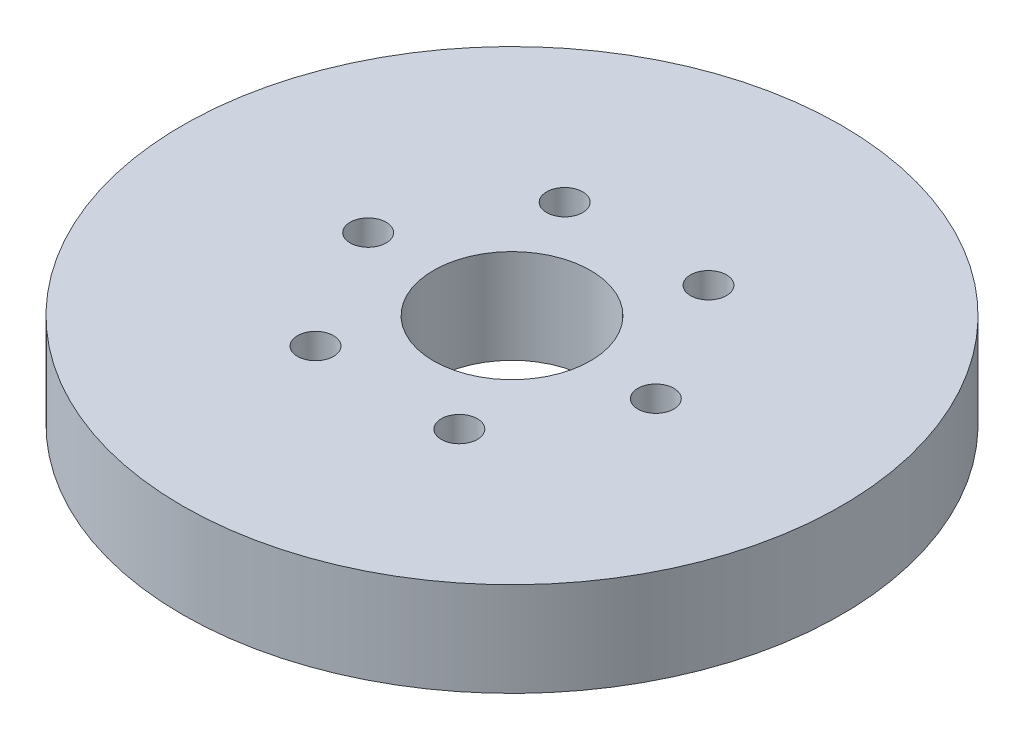
ISO-10303-21;
HEADER;
FILE_DESCRIPTION(('STEP AP214'),'2;1');
FILE_NAME('part.step','',(''),(''),'','','');
FILE_SCHEMA(('AUTOMOTIVE_DESIGN { 1 0 10303 214 1 1 1 1 }'));
ENDSEC;
DATA;
#1=APPLICATION_CONTEXT('core data for automotive mechanical design processes');
#2=APPLICATION_PROTOCOL_DEFINITION('international standard','automotive_design',2000,#1);
#3=PRODUCT_CONTEXT('',#1,'mechanical');
#4=PRODUCT('Part','Part','',(#3));
#5=PRODUCT_RELATED_PRODUCT_CATEGORY('part','',(#4));
#6=PRODUCT_DEFINITION_FORMATION('','',#4);
#7=PRODUCT_DEFINITION_CONTEXT('part definition',#1,'design');
#8=PRODUCT_DEFINITION('design','',#6,#7);
#9=PRODUCT_DEFINITION_SHAPE('','',#8);
#10=(LENGTH_UNIT() NAMED_UNIT(*) SI_UNIT(.MILLI.,.METRE.));
#11=(NAMED_UNIT(*) PLANE_ANGLE_UNIT() SI_UNIT($,.RADIAN.));
#12=(NAMED_UNIT(*) SI_UNIT($,.STERADIAN.) SOLID_ANGLE_UNIT());
#13=UNCERTAINTY_MEASURE_WITH_UNIT(LENGTH_MEASURE(1.E-05),#10,'distance_accuracy_value','');
#14=(GEOMETRIC_REPRESENTATION_CONTEXT(3) GLOBAL_UNCERTAINTY_ASSIGNED_CONTEXT((#13)) GLOBAL_UNIT_ASSIGNED_CONTEXT((#10,
#11,#12)) REPRESENTATION_CONTEXT('',''));
#15=CARTESIAN_POINT('',(0.,0.,0.));
#16=DIRECTION('',(0.,0.,1.));
#17=DIRECTION('',(1.,0.,0.));
#18=AXIS2_PLACEMENT_3D('',#15,#16,#17);
#19=CARTESIAN_POINT('',(0.,15.,0.));
#20=DIRECTION('',(0.,-1.,0.));
#21=DIRECTION('',(0.,0.,-1.));
#22=AXIS2_PLACEMENT_3D('',#19,#20,#21);
#23=CYLINDRICAL_SURFACE('',#22,52.5);
#24=CARTESIAN_POINT('',(0.,15.,0.));
#25=DIRECTION('',(0.,1.,0.));
#26=DIRECTION('',(0.,0.,1.));
#27=AXIS2_PLACEMENT_3D('',#24,#25,#26);
#28=CIRCLE('',#27,52.5);
#29=CARTESIAN_POINT('',(0.,15.,52.5));
#30=VERTEX_POINT('',#29);
#31=EDGE_CURVE('E10',#30,#30,#28,.T.);
#32=ORIENTED_EDGE('',*,*,#31,.F.);
#33=EDGE_LOOP('',(#32));
#34=FACE_BOUND('',#33,.T.);
#35=CARTESIAN_POINT('',(0.,0.,0.));
#36=DIRECTION('',(0.,1.,0.));
#37=DIRECTION('',(0.,0.,1.));
#38=AXIS2_PLACEMENT_3D('',#35,#36,#37);
#39=CIRCLE('',#38,52.5);
#40=CARTESIAN_POINT('',(0.,0.,52.5));
#41=VERTEX_POINT('',#40);
#42=EDGE_CURVE('E37',#41,#41,#39,.T.);
#43=ORIENTED_EDGE('',*,*,#42,.T.);
#44=EDGE_LOOP('',(#43));
#45=FACE_BOUND('',#44,.T.);
#46=ADVANCED_FACE('F40',(#34,#45),#23,.T.);
#47=CARTESIAN_POINT('',(0.,15.,0.));
#48=DIRECTION('',(0.,1.,0.));
#49=DIRECTION('',(0.,0.,1.));
#50=AXIS2_PLACEMENT_3D('',#47,#48,#49);
#51=PLANE('',#50);
#52=CARTESIAN_POINT('',(-11.45673578227,15.,-19.8436484637835));
#53=DIRECTION('',(0.,1.,0.));
#54=DIRECTION('',(-0.866025403784433,0.,0.50000000000001));
#55=AXIS2_PLACEMENT_3D('',#52,#53,#54);
#56=CIRCLE('',#55,2.86890135315248);
#57=CARTESIAN_POINT('',(-13.9412772350516,15.,-18.4091977872072));
#58=VERTEX_POINT('',#57);
#59=EDGE_CURVE('E70',#58,#58,#56,.T.);
#60=ORIENTED_EDGE('',*,*,#59,.F.);
#61=EDGE_LOOP('',(#60));
#62=FACE_BOUND('',#61,.T.);
#63=CARTESIAN_POINT('',(11.4567357822696,15.,-19.8436484637837));
#64=DIRECTION('',(0.,1.,0.));
#65=DIRECTION('',(-0.866025403784443,0.,-0.499999999999992));
#66=AXIS2_PLACEMENT_3D('',#63,#64,#65);
#67=CIRCLE('',#66,2.86890135315248);
#68=CARTESIAN_POINT('',(8.97219432948797,15.,-21.2780991403599));
#69=VERTEX_POINT('',#68);
#70=EDGE_CURVE('E71',#69,#69,#67,.T.);
#71=ORIENTED_EDGE('',*,*,#70,.F.);
#72=EDGE_LOOP('',(#71));
#73=FACE_BOUND('',#72,.T.);
#74=CARTESIAN_POINT('',(22.9134715645395,15.,0.));
#75=DIRECTION('',(0.,1.,0.));
#76=DIRECTION('',(0.,0.,-1.));
#77=AXIS2_PLACEMENT_3D('',#74,#75,#76);
#78=CIRCLE('',#77,2.86890135315248);
#79=CARTESIAN_POINT('',(22.9134715645395,15.,-2.86890135315248));
#80=VERTEX_POINT('',#79);
#81=EDGE_CURVE('E78',#80,#80,#78,.T.);
#82=ORIENTED_EDGE('',*,*,#81,.F.);
#83=EDGE_LOOP('',(#82));
#84=FACE_BOUND('',#83,.T.);
#85=CARTESIAN_POINT('',(11.4567357822699,15.,19.8436484637836));
#86=DIRECTION('',(0.,1.,0.));
#87=DIRECTION('',(0.866025403784436,0.,-0.500000000000004));
#88=AXIS2_PLACEMENT_3D('',#85,#86,#87);
#89=CIRCLE('',#88,2.86890135315248);
#90=CARTESIAN_POINT('',(13.9412772350515,15.,18.4091977872073));
#91=VERTEX_POINT('',#90);
#92=EDGE_CURVE('E84',#91,#91,#89,.T.);
#93=ORIENTED_EDGE('',*,*,#92,.F.);
#94=EDGE_LOOP('',(#93));
#95=FACE_BOUND('',#94,.T.);
#96=CARTESIAN_POINT('',(-11.4567357822697,15.,19.8436484637836));
#97=DIRECTION('',(0.,1.,0.));
#98=DIRECTION('',(0.86602540378444,0.,0.499999999999998));
#99=AXIS2_PLACEMENT_3D('',#96,#97,#98);
#100=CIRCLE('',#99,2.86890135315248);
#101=CARTESIAN_POINT('',(-8.97219432948812,15.,21.2780991403599));
#102=VERTEX_POINT('',#101);
#103=EDGE_CURVE('E61',#102,#102,#100,.T.);
#104=ORIENTED_EDGE('',*,*,#103,.F.);
#105=EDGE_LOOP('',(#104));
#106=FACE_BOUND('',#105,.T.);
#107=CARTESIAN_POINT('',(-22.9134715645395,15.,0.));
#108=DIRECTION('',(0.,1.,0.));
#109=DIRECTION('',(0.,0.,1.));
#110=AXIS2_PLACEMENT_3D('',#107,#108,#109);
#111=CIRCLE('',#110,2.86890135315248);
#112=CARTESIAN_POINT('',(-22.9134715645395,15.,2.86890135315248));
#113=VERTEX_POINT('',#112);
#114=EDGE_CURVE('E54',#113,#113,#111,.T.);
#115=ORIENTED_EDGE('',*,*,#114,.F.);
#116=EDGE_LOOP('',(#115));
#117=FACE_BOUND('',#116,.T.);
#118=CARTESIAN_POINT('',(0.,15.,0.));
#119=DIRECTION('',(0.,1.,0.));
#120=DIRECTION('',(0.,0.,1.));
#121=AXIS2_PLACEMENT_3D('',#118,#119,#120);
#122=CIRCLE('',#121,12.5);
#123=CARTESIAN_POINT('',(0.,15.,12.5));
#124=VERTEX_POINT('',#123);
#125=EDGE_CURVE('E50',#124,#124,#122,.T.);
#126=ORIENTED_EDGE('',*,*,#125,.F.);
#127=EDGE_LOOP('',(#126));
#128=FACE_BOUND('',#127,.T.);
#129=ORIENTED_EDGE('',*,*,#31,.T.);
#130=EDGE_LOOP('',(#129));
#131=FACE_BOUND('',#130,.T.);
#132=ADVANCED_FACE('F99',(#62,#73,#84,#95,#106,#117,#128,#131),#51,.T.);
#133=CARTESIAN_POINT('',(0.,0.,0.));
#134=DIRECTION('',(0.,1.,0.));
#135=DIRECTION('',(0.,0.,1.));
#136=AXIS2_PLACEMENT_3D('',#133,#134,#135);
#137=PLANE('',#136);
#138=CARTESIAN_POINT('',(0.,0.,0.));
#139=DIRECTION('',(0.,1.,0.));
#140=DIRECTION('',(0.,0.,1.));
#141=AXIS2_PLACEMENT_3D('',#138,#139,#140);
#142=CIRCLE('',#141,12.5);
#143=CARTESIAN_POINT('',(0.,0.,12.5));
#144=VERTEX_POINT('',#143);
#145=EDGE_CURVE('E47',#144,#144,#142,.T.);
#146=ORIENTED_EDGE('',*,*,#145,.T.);
#147=EDGE_LOOP('',(#146));
#148=FACE_BOUND('',#147,.T.);
#149=ORIENTED_EDGE('',*,*,#42,.F.);
#150=EDGE_LOOP('',(#149));
#151=FACE_BOUND('',#150,.T.);
#152=ADVANCED_FACE('F103',(#148,#151),#137,.F.);
#153=CARTESIAN_POINT('',(0.,15.,0.));
#154=DIRECTION('',(0.,-1.,0.));
#155=DIRECTION('',(0.,0.,-1.));
#156=AXIS2_PLACEMENT_3D('',#153,#154,#155);
#157=CYLINDRICAL_SURFACE('',#156,12.5);
#158=ORIENTED_EDGE('',*,*,#125,.T.);
#159=EDGE_LOOP('',(#158));
#160=FACE_BOUND('',#159,.T.);
#161=ORIENTED_EDGE('',*,*,#145,.F.);
#162=EDGE_LOOP('',(#161));
#163=FACE_BOUND('',#162,.T.);
#164=ADVANCED_FACE('F115',(#160,#163),#157,.F.);
#165=CARTESIAN_POINT('',(-22.9134715645395,0.996548716622575,0.));
#166=DIRECTION('',(0.,1.,0.));
#167=DIRECTION('',(0.,0.,1.));
#168=AXIS2_PLACEMENT_3D('',#165,#166,#167);
#169=CYLINDRICAL_SURFACE('',#168,2.86890135315248);
#170=CARTESIAN_POINT('',(-22.9134715645395,0.996548716622575,0.));
#171=DIRECTION('',(0.,1.,0.));
#172=DIRECTION('',(0.,0.,1.));
#173=AXIS2_PLACEMENT_3D('',#170,#171,#172);
#174=CIRCLE('',#173,2.86890135315248);
#175=CARTESIAN_POINT('',(-22.9134715645395,0.996548716622575,2.86890135315248));
#176=VERTEX_POINT('',#175);
#177=EDGE_CURVE('E55',#176,#176,#174,.T.);
#178=ORIENTED_EDGE('',*,*,#177,.F.);
#179=EDGE_LOOP('',(#178));
#180=FACE_BOUND('',#179,.T.);
#181=ORIENTED_EDGE('',*,*,#114,.T.);
#182=EDGE_LOOP('',(#181));
#183=FACE_BOUND('',#182,.T.);
#184=ADVANCED_FACE('F113',(#180,#183),#169,.F.);
#185=CARTESIAN_POINT('',(-22.9134715645395,0.996548716622575,0.));
#186=DIRECTION('',(0.,1.,0.));
#187=DIRECTION('',(0.,0.,1.));
#188=AXIS2_PLACEMENT_3D('',#185,#186,#187);
#189=PLANE('',#188);
#190=ORIENTED_EDGE('',*,*,#177,.T.);
#191=EDGE_LOOP('',(#190));
#192=FACE_BOUND('',#191,.T.);
#193=ADVANCED_FACE('F144',(#192),#189,.T.);
#194=CARTESIAN_POINT('',(-11.4567357822697,0.996548716622575,19.8436484637836));
#195=DIRECTION('',(0.,1.,0.));
#196=DIRECTION('',(0.,0.,1.));
#197=AXIS2_PLACEMENT_3D('',#194,#195,#196);
#198=CYLINDRICAL_SURFACE('',#197,2.86890135315248);
#199=CARTESIAN_POINT('',(-11.4567357822697,0.996548716622575,19.8436484637836));
#200=DIRECTION('',(0.,1.,0.));
#201=DIRECTION('',(0.86602540378444,0.,0.499999999999998));
#202=AXIS2_PLACEMENT_3D('',#199,#200,#201);
#203=CIRCLE('',#202,2.86890135315248);
#204=CARTESIAN_POINT('',(-8.97219432948812,0.996548716622575,21.2780991403599));
#205=VERTEX_POINT('',#204);
#206=EDGE_CURVE('E59',#205,#205,#203,.T.);
#207=ORIENTED_EDGE('',*,*,#206,.F.);
#208=EDGE_LOOP('',(#207));
#209=FACE_BOUND('',#208,.T.);
#210=ORIENTED_EDGE('',*,*,#103,.T.);
#211=EDGE_LOOP('',(#210));
#212=FACE_BOUND('',#211,.T.);
#213=ADVANCED_FACE('F153',(#209,#212),#198,.F.);
#214=CARTESIAN_POINT('',(-11.4567357822697,0.996548716622575,19.8436484637836));
#215=DIRECTION('',(0.,1.,0.));
#216=DIRECTION('',(0.86602540378444,0.,0.499999999999998));
#217=AXIS2_PLACEMENT_3D('',#214,#215,#216);
#218=PLANE('',#217);
#219=ORIENTED_EDGE('',*,*,#206,.T.);
#220=EDGE_LOOP('',(#219));
#221=FACE_BOUND('',#220,.T.);
#222=ADVANCED_FACE('F96',(#221),#218,.T.);
#223=CARTESIAN_POINT('',(11.4567357822699,0.996548716622575,19.8436484637836));
#224=DIRECTION('',(0.,1.,0.));
#225=DIRECTION('',(0.,0.,1.));
#226=AXIS2_PLACEMENT_3D('',#223,#224,#225);
#227=CYLINDRICAL_SURFACE('',#226,2.86890135315248);
#228=CARTESIAN_POINT('',(11.4567357822699,0.996548716622575,19.8436484637836));
#229=DIRECTION('',(0.,1.,0.));
#230=DIRECTION('',(0.866025403784436,0.,-0.500000000000004));
#231=AXIS2_PLACEMENT_3D('',#228,#229,#230);
#232=CIRCLE('',#231,2.86890135315248);
#233=CARTESIAN_POINT('',(13.9412772350515,0.996548716622575,18.4091977872073));
#234=VERTEX_POINT('',#233);
#235=EDGE_CURVE('E63',#234,#234,#232,.T.);
#236=ORIENTED_EDGE('',*,*,#235,.F.);
#237=EDGE_LOOP('',(#236));
#238=FACE_BOUND('',#237,.T.);
#239=ORIENTED_EDGE('',*,*,#92,.T.);
#240=EDGE_LOOP('',(#239));
#241=FACE_BOUND('',#240,.T.);
#242=ADVANCED_FACE('F91',(#238,#241),#227,.F.);
#243=CARTESIAN_POINT('',(11.4567357822699,0.996548716622575,19.8436484637836));
#244=DIRECTION('',(0.,1.,0.));
#245=DIRECTION('',(0.866025403784436,0.,-0.500000000000004));
#246=AXIS2_PLACEMENT_3D('',#243,#244,#245);
#247=PLANE('',#246);
#248=ORIENTED_EDGE('',*,*,#235,.T.);
#249=EDGE_LOOP('',(#248));
#250=FACE_BOUND('',#249,.T.);
#251=ADVANCED_FACE('F93',(#250),#247,.T.);
#252=CARTESIAN_POINT('',(22.9134715645395,0.996548716622575,0.));
#253=DIRECTION('',(0.,1.,0.));
#254=DIRECTION('',(0.,0.,1.));
#255=AXIS2_PLACEMENT_3D('',#252,#253,#254);
#256=CYLINDRICAL_SURFACE('',#255,2.86890135315248);
#257=CARTESIAN_POINT('',(22.9134715645395,0.996548716622575,0.));
#258=DIRECTION('',(0.,1.,0.));
#259=DIRECTION('',(0.,0.,-1.));
#260=AXIS2_PLACEMENT_3D('',#257,#258,#259);
#261=CIRCLE('',#260,2.86890135315248);
#262=CARTESIAN_POINT('',(22.9134715645395,0.996548716622575,-2.86890135315248));
#263=VERTEX_POINT('',#262);
#264=EDGE_CURVE('E85',#263,#263,#261,.T.);
#265=ORIENTED_EDGE('',*,*,#264,.F.);
#266=EDGE_LOOP('',(#265));
#267=FACE_BOUND('',#266,.T.);
#268=ORIENTED_EDGE('',*,*,#81,.T.);
#269=EDGE_LOOP('',(#268));
#270=FACE_BOUND('',#269,.T.);
#271=ADVANCED_FACE('F187',(#267,#270),#256,.F.);
#272=CARTESIAN_POINT('',(22.9134715645395,0.996548716622575,0.));
#273=DIRECTION('',(0.,1.,0.));
#274=DIRECTION('',(0.,0.,-1.));
#275=AXIS2_PLACEMENT_3D('',#272,#273,#274);
#276=PLANE('',#275);
#277=ORIENTED_EDGE('',*,*,#264,.T.);
#278=EDGE_LOOP('',(#277));
#279=FACE_BOUND('',#278,.T.);
#280=ADVANCED_FACE('F198',(#279),#276,.T.);
#281=CARTESIAN_POINT('',(11.4567357822696,0.996548716622575,-19.8436484637837));
#282=DIRECTION('',(0.,1.,0.));
#283=DIRECTION('',(0.,0.,1.));
#284=AXIS2_PLACEMENT_3D('',#281,#282,#283);
#285=CYLINDRICAL_SURFACE('',#284,2.86890135315248);
#286=CARTESIAN_POINT('',(11.4567357822696,0.996548716622575,-19.8436484637837));
#287=DIRECTION('',(0.,1.,0.));
#288=DIRECTION('',(-0.866025403784443,0.,-0.499999999999992));
#289=AXIS2_PLACEMENT_3D('',#286,#287,#288);
#290=CIRCLE('',#289,2.86890135315248);
#291=CARTESIAN_POINT('',(8.97219432948797,0.996548716622575,-21.2780991403599));
#292=VERTEX_POINT('',#291);
#293=EDGE_CURVE('E76',#292,#292,#290,.T.);
#294=ORIENTED_EDGE('',*,*,#293,.F.);
#295=EDGE_LOOP('',(#294));
#296=FACE_BOUND('',#295,.T.);
#297=ORIENTED_EDGE('',*,*,#70,.T.);
#298=EDGE_LOOP('',(#297));
#299=FACE_BOUND('',#298,.T.);
#300=ADVANCED_FACE('F202',(#296,#299),#285,.F.);
#301=CARTESIAN_POINT('',(11.4567357822696,0.996548716622575,-19.8436484637837));
#302=DIRECTION('',(0.,1.,0.));
#303=DIRECTION('',(-0.866025403784443,0.,-0.499999999999992));
#304=AXIS2_PLACEMENT_3D('',#301,#302,#303);
#305=PLANE('',#304);
#306=ORIENTED_EDGE('',*,*,#293,.T.);
#307=EDGE_LOOP('',(#306));
#308=FACE_BOUND('',#307,.T.);
#309=ADVANCED_FACE('F212',(#308),#305,.T.);
#310=CARTESIAN_POINT('',(-11.45673578227,0.996548716622575,-19.8436484637835));
#311=DIRECTION('',(0.,1.,0.));
#312=DIRECTION('',(0.,0.,1.));
#313=AXIS2_PLACEMENT_3D('',#310,#311,#312);
#314=CYLINDRICAL_SURFACE('',#313,2.86890135315248);
#315=CARTESIAN_POINT('',(-11.45673578227,0.996548716622575,-19.8436484637835));
#316=DIRECTION('',(0.,1.,0.));
#317=DIRECTION('',(-0.866025403784433,0.,0.50000000000001));
#318=AXIS2_PLACEMENT_3D('',#315,#316,#317);
#319=CIRCLE('',#318,2.86890135315248);
#320=CARTESIAN_POINT('',(-13.9412772350516,0.996548716622575,-18.4091977872072));
#321=VERTEX_POINT('',#320);
#322=EDGE_CURVE('E69',#321,#321,#319,.T.);
#323=ORIENTED_EDGE('',*,*,#322,.F.);
#324=EDGE_LOOP('',(#323));
#325=FACE_BOUND('',#324,.T.);
#326=ORIENTED_EDGE('',*,*,#59,.T.);
#327=EDGE_LOOP('',(#326));
#328=FACE_BOUND('',#327,.T.);
#329=ADVANCED_FACE('F224',(#325,#328),#314,.F.);
#330=CARTESIAN_POINT('',(-11.45673578227,0.996548716622575,-19.8436484637835));
#331=DIRECTION('',(0.,1.,0.));
#332=DIRECTION('',(-0.866025403784433,0.,0.50000000000001));
#333=AXIS2_PLACEMENT_3D('',#330,#331,#332);
#334=PLANE('',#333);
#335=ORIENTED_EDGE('',*,*,#322,.T.);
#336=EDGE_LOOP('',(#335));
#337=FACE_BOUND('',#336,.T.);
#338=ADVANCED_FACE('F235',(#337),#334,.T.);
#339=CLOSED_SHELL('',(#46,#132,#152,#164,#184,#193,#213,#222,#242,#251,#271,#280,#300,#309,#329,#338));
#340=MANIFOLD_SOLID_BREP('B2',#339);
#341=ADVANCED_BREP_SHAPE_REPRESENTATION('',(#18,#340),#14);
#342=SHAPE_DEFINITION_REPRESENTATION(#9,#341);
ENDSEC;
END-ISO-10303-21;
